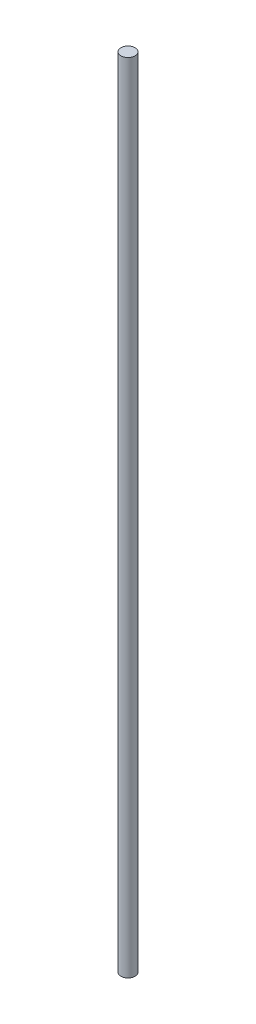
ISO-10303-21;
HEADER;
FILE_DESCRIPTION(('STEP AP214'),'2;1');
FILE_NAME('part.step','',(''),(''),'','','');
FILE_SCHEMA(('AUTOMOTIVE_DESIGN { 1 0 10303 214 1 1 1 1 }'));
ENDSEC;
DATA;
#1=APPLICATION_CONTEXT('core data for automotive mechanical design processes');
#2=APPLICATION_PROTOCOL_DEFINITION('international standard','automotive_design',2000,#1);
#3=PRODUCT_CONTEXT('',#1,'mechanical');
#4=PRODUCT('Part','Part','',(#3));
#5=PRODUCT_RELATED_PRODUCT_CATEGORY('part','',(#4));
#6=PRODUCT_DEFINITION_FORMATION('','',#4);
#7=PRODUCT_DEFINITION_CONTEXT('part definition',#1,'design');
#8=PRODUCT_DEFINITION('design','',#6,#7);
#9=PRODUCT_DEFINITION_SHAPE('','',#8);
#10=(LENGTH_UNIT() NAMED_UNIT(*) SI_UNIT(.MILLI.,.METRE.));
#11=(NAMED_UNIT(*) PLANE_ANGLE_UNIT() SI_UNIT($,.RADIAN.));
#12=(NAMED_UNIT(*) SI_UNIT($,.STERADIAN.) SOLID_ANGLE_UNIT());
#13=UNCERTAINTY_MEASURE_WITH_UNIT(LENGTH_MEASURE(1.E-05),#10,'distance_accuracy_value','');
#14=(GEOMETRIC_REPRESENTATION_CONTEXT(3) GLOBAL_UNCERTAINTY_ASSIGNED_CONTEXT((#13)) GLOBAL_UNIT_ASSIGNED_CONTEXT((#10,
#11,#12)) REPRESENTATION_CONTEXT('',''));
#15=CARTESIAN_POINT('',(0.,0.,0.));
#16=DIRECTION('',(0.,0.,1.));
#17=DIRECTION('',(1.,0.,0.));
#18=AXIS2_PLACEMENT_3D('',#15,#16,#17);
#19=CARTESIAN_POINT('',(0.,281.999999999999,0.));
#20=DIRECTION('',(0.,-1.,0.));
#21=DIRECTION('',(0.,0.,-1.));
#22=AXIS2_PLACEMENT_3D('',#19,#20,#21);
#23=CYLINDRICAL_SURFACE('',#22,2.5);
#24=CARTESIAN_POINT('',(0.,281.999999999999,0.));
#25=DIRECTION('',(0.,1.,0.));
#26=DIRECTION('',(0.,0.,1.));
#27=AXIS2_PLACEMENT_3D('',#24,#25,#26);
#28=CIRCLE('',#27,2.5);
#29=CARTESIAN_POINT('',(0.,281.999999999999,2.5));
#30=VERTEX_POINT('',#29);
#31=EDGE_CURVE('E10',#30,#30,#28,.T.);
#32=ORIENTED_EDGE('',*,*,#31,.F.);
#33=EDGE_LOOP('',(#32));
#34=FACE_BOUND('',#33,.T.);
#35=CARTESIAN_POINT('',(0.,0.,0.));
#36=DIRECTION('',(0.,1.,0.));
#37=DIRECTION('',(0.,0.,1.));
#38=AXIS2_PLACEMENT_3D('',#35,#36,#37);
#39=CIRCLE('',#38,2.5);
#40=CARTESIAN_POINT('',(0.,0.,2.5));
#41=VERTEX_POINT('',#40);
#42=EDGE_CURVE('E35',#41,#41,#39,.T.);
#43=ORIENTED_EDGE('',*,*,#42,.T.);
#44=EDGE_LOOP('',(#43));
#45=FACE_BOUND('',#44,.T.);
#46=ADVANCED_FACE('F32',(#34,#45),#23,.T.);
#47=CARTESIAN_POINT('',(0.,281.999999999999,0.));
#48=DIRECTION('',(0.,1.,0.));
#49=DIRECTION('',(0.,0.,1.));
#50=AXIS2_PLACEMENT_3D('',#47,#48,#49);
#51=PLANE('',#50);
#52=ORIENTED_EDGE('',*,*,#31,.T.);
#53=EDGE_LOOP('',(#52));
#54=FACE_BOUND('',#53,.T.);
#55=ADVANCED_FACE('F47',(#54),#51,.T.);
#56=CARTESIAN_POINT('',(0.,0.,0.));
#57=DIRECTION('',(0.,1.,0.));
#58=DIRECTION('',(0.,0.,1.));
#59=AXIS2_PLACEMENT_3D('',#56,#57,#58);
#60=PLANE('',#59);
#61=ORIENTED_EDGE('',*,*,#42,.F.);
#62=EDGE_LOOP('',(#61));
#63=FACE_BOUND('',#62,.T.);
#64=ADVANCED_FACE('F45',(#63),#60,.F.);
#65=CLOSED_SHELL('',(#46,#55,#64));
#66=MANIFOLD_SOLID_BREP('B2',#65);
#67=ADVANCED_BREP_SHAPE_REPRESENTATION('',(#18,#66),#14);
#68=SHAPE_DEFINITION_REPRESENTATION(#9,#67);
ENDSEC;
END-ISO-10303-21;
